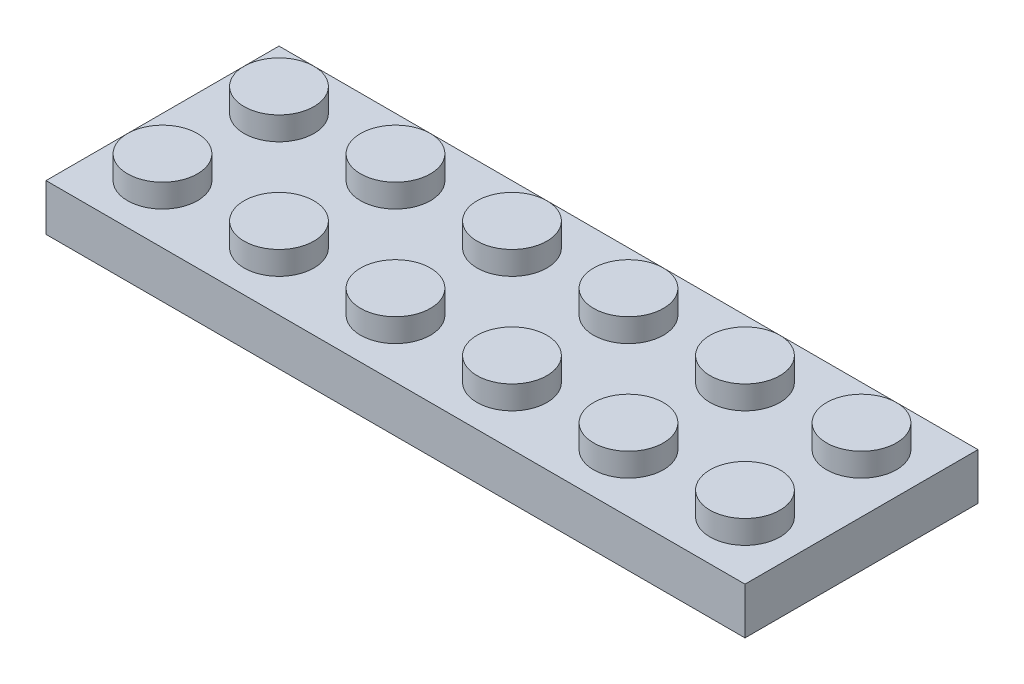
ISO-10303-21;
HEADER;
FILE_DESCRIPTION(('STEP AP214'),'2;1');
FILE_NAME('part.step','',(''),(''),'','','');
FILE_SCHEMA(('AUTOMOTIVE_DESIGN { 1 0 10303 214 1 1 1 1 }'));
ENDSEC;
DATA;
#1=APPLICATION_CONTEXT('core data for automotive mechanical design processes');
#2=APPLICATION_PROTOCOL_DEFINITION('international standard','automotive_design',2000,#1);
#3=PRODUCT_CONTEXT('',#1,'mechanical');
#4=PRODUCT('Part','Part','',(#3));
#5=PRODUCT_RELATED_PRODUCT_CATEGORY('part','',(#4));
#6=PRODUCT_DEFINITION_FORMATION('','',#4);
#7=PRODUCT_DEFINITION_CONTEXT('part definition',#1,'design');
#8=PRODUCT_DEFINITION('design','',#6,#7);
#9=PRODUCT_DEFINITION_SHAPE('','',#8);
#10=(LENGTH_UNIT() NAMED_UNIT(*) SI_UNIT(.MILLI.,.METRE.));
#11=(NAMED_UNIT(*) PLANE_ANGLE_UNIT() SI_UNIT($,.RADIAN.));
#12=(NAMED_UNIT(*) SI_UNIT($,.STERADIAN.) SOLID_ANGLE_UNIT());
#13=UNCERTAINTY_MEASURE_WITH_UNIT(LENGTH_MEASURE(1.E-05),#10,'distance_accuracy_value','');
#14=(GEOMETRIC_REPRESENTATION_CONTEXT(3) GLOBAL_UNCERTAINTY_ASSIGNED_CONTEXT((#13)) GLOBAL_UNIT_ASSIGNED_CONTEXT((#10,
#11,#12)) REPRESENTATION_CONTEXT('',''));
#15=CARTESIAN_POINT('',(0.,0.,0.));
#16=DIRECTION('',(0.,0.,1.));
#17=DIRECTION('',(1.,0.,0.));
#18=AXIS2_PLACEMENT_3D('',#15,#16,#17);
#19=CARTESIAN_POINT('',(-2.5,2.,-2.5));
#20=DIRECTION('',(0.,-1.,0.));
#21=DIRECTION('',(0.,0.,-1.));
#22=AXIS2_PLACEMENT_3D('',#19,#20,#21);
#23=CYLINDRICAL_SURFACE('',#22,1.5);
#24=CARTESIAN_POINT('',(-2.5,1.,-2.5));
#25=DIRECTION('',(0.,1.,0.));
#26=DIRECTION('',(0.,0.,1.));
#27=AXIS2_PLACEMENT_3D('',#24,#25,#26);
#28=CIRCLE('',#27,1.5);
#29=CARTESIAN_POINT('',(-2.5,1.,-1.));
#30=VERTEX_POINT('',#29);
#31=EDGE_CURVE('E185',#30,#30,#28,.T.);
#32=ORIENTED_EDGE('',*,*,#31,.T.);
#33=EDGE_LOOP('',(#32));
#34=FACE_BOUND('',#33,.T.);
#35=CARTESIAN_POINT('',(-2.5,2.,-2.5));
#36=DIRECTION('',(0.,1.,0.));
#37=DIRECTION('',(0.,0.,1.));
#38=AXIS2_PLACEMENT_3D('',#35,#36,#37);
#39=CIRCLE('',#38,1.5);
#40=CARTESIAN_POINT('',(-2.5,2.,-1.));
#41=VERTEX_POINT('',#40);
#42=EDGE_CURVE('E315',#41,#41,#39,.T.);
#43=ORIENTED_EDGE('',*,*,#42,.F.);
#44=EDGE_LOOP('',(#43));
#45=FACE_BOUND('',#44,.T.);
#46=ADVANCED_FACE('F110',(#34,#45),#23,.T.);
#47=CARTESIAN_POINT('',(0.,2.,0.));
#48=DIRECTION('',(0.,1.,0.));
#49=DIRECTION('',(0.,0.,1.));
#50=AXIS2_PLACEMENT_3D('',#47,#48,#49);
#51=PLANE('',#50);
#52=ORIENTED_EDGE('',*,*,#42,.T.);
#53=EDGE_LOOP('',(#52));
#54=FACE_BOUND('',#53,.T.);
#55=ADVANCED_FACE('F359',(#54),#51,.T.);
#56=CARTESIAN_POINT('',(-15.,1.,5.));
#57=DIRECTION('',(0.,0.,-1.));
#58=DIRECTION('',(-1.,0.,0.));
#59=AXIS2_PLACEMENT_3D('',#56,#57,#58);
#60=PLANE('',#59);
#61=DIRECTION('',(0.,-1.,0.));
#62=VECTOR('',#61,1.);
#63=CARTESIAN_POINT('',(-15.,1.,5.));
#64=LINE('',#63,#62);
#65=CARTESIAN_POINT('',(-15.,1.,5.));
#66=VERTEX_POINT('',#65);
#67=CARTESIAN_POINT('',(-15.,-1.,5.));
#68=VERTEX_POINT('',#67);
#69=EDGE_CURVE('E132',#66,#68,#64,.T.);
#70=ORIENTED_EDGE('',*,*,#69,.T.);
#71=DIRECTION('',(1.,0.,0.));
#72=VECTOR('',#71,1.);
#73=CARTESIAN_POINT('',(0.,-1.,5.));
#74=LINE('',#73,#72);
#75=CARTESIAN_POINT('',(15.,-1.,5.));
#76=VERTEX_POINT('',#75);
#77=EDGE_CURVE('E194',#68,#76,#74,.T.);
#78=ORIENTED_EDGE('',*,*,#77,.T.);
#79=DIRECTION('',(0.,-1.,0.));
#80=VECTOR('',#79,1.);
#81=CARTESIAN_POINT('',(15.,1.,5.));
#82=LINE('',#81,#80);
#83=CARTESIAN_POINT('',(15.,1.,5.));
#84=VERTEX_POINT('',#83);
#85=EDGE_CURVE('E176',#84,#76,#82,.T.);
#86=ORIENTED_EDGE('',*,*,#85,.F.);
#87=DIRECTION('',(1.,0.,0.));
#88=VECTOR('',#87,1.);
#89=CARTESIAN_POINT('',(-15.,1.,5.));
#90=LINE('',#89,#88);
#91=EDGE_CURVE('E303',#66,#84,#90,.T.);
#92=ORIENTED_EDGE('',*,*,#91,.F.);
#93=EDGE_LOOP('',(#70,#78,#86,#92));
#94=FACE_BOUND('',#93,.T.);
#95=ADVANCED_FACE('F198',(#94),#60,.F.);
#96=CARTESIAN_POINT('',(15.,1.,5.));
#97=DIRECTION('',(-1.,0.,0.));
#98=DIRECTION('',(0.,0.,1.));
#99=AXIS2_PLACEMENT_3D('',#96,#97,#98);
#100=PLANE('',#99);
#101=ORIENTED_EDGE('',*,*,#85,.T.);
#102=DIRECTION('',(0.,0.,-1.));
#103=VECTOR('',#102,1.);
#104=CARTESIAN_POINT('',(15.,-1.,0.));
#105=LINE('',#104,#103);
#106=CARTESIAN_POINT('',(15.,-1.,-5.));
#107=VERTEX_POINT('',#106);
#108=EDGE_CURVE('E180',#76,#107,#105,.T.);
#109=ORIENTED_EDGE('',*,*,#108,.T.);
#110=DIRECTION('',(0.,-1.,0.));
#111=VECTOR('',#110,1.);
#112=CARTESIAN_POINT('',(15.,1.,-5.));
#113=LINE('',#112,#111);
#114=CARTESIAN_POINT('',(15.,1.,-5.));
#115=VERTEX_POINT('',#114);
#116=EDGE_CURVE('E186',#115,#107,#113,.T.);
#117=ORIENTED_EDGE('',*,*,#116,.F.);
#118=DIRECTION('',(0.,0.,-1.));
#119=VECTOR('',#118,1.);
#120=CARTESIAN_POINT('',(15.,1.,5.));
#121=LINE('',#120,#119);
#122=EDGE_CURVE('E181',#84,#115,#121,.T.);
#123=ORIENTED_EDGE('',*,*,#122,.F.);
#124=EDGE_LOOP('',(#101,#109,#117,#123));
#125=FACE_BOUND('',#124,.T.);
#126=ADVANCED_FACE('F178',(#125),#100,.F.);
#127=CARTESIAN_POINT('',(-15.,1.,-5.));
#128=DIRECTION('',(0.,0.,-1.));
#129=DIRECTION('',(-1.,0.,0.));
#130=AXIS2_PLACEMENT_3D('',#127,#128,#129);
#131=PLANE('',#130);
#132=ORIENTED_EDGE('',*,*,#116,.T.);
#133=DIRECTION('',(1.,0.,0.));
#134=VECTOR('',#133,1.);
#135=CARTESIAN_POINT('',(0.,-1.,-5.));
#136=LINE('',#135,#134);
#137=CARTESIAN_POINT('',(-15.,-1.,-5.));
#138=VERTEX_POINT('',#137);
#139=EDGE_CURVE('E196',#138,#107,#136,.T.);
#140=ORIENTED_EDGE('',*,*,#139,.F.);
#141=DIRECTION('',(0.,-1.,0.));
#142=VECTOR('',#141,1.);
#143=CARTESIAN_POINT('',(-15.,1.,-5.));
#144=LINE('',#143,#142);
#145=CARTESIAN_POINT('',(-15.,1.,-5.));
#146=VERTEX_POINT('',#145);
#147=EDGE_CURVE('E312',#146,#138,#144,.T.);
#148=ORIENTED_EDGE('',*,*,#147,.F.);
#149=DIRECTION('',(1.,0.,0.));
#150=VECTOR('',#149,1.);
#151=CARTESIAN_POINT('',(-15.,1.,-5.));
#152=LINE('',#151,#150);
#153=EDGE_CURVE('E306',#146,#115,#152,.T.);
#154=ORIENTED_EDGE('',*,*,#153,.T.);
#155=EDGE_LOOP('',(#132,#140,#148,#154));
#156=FACE_BOUND('',#155,.T.);
#157=ADVANCED_FACE('F379',(#156),#131,.T.);
#158=CARTESIAN_POINT('',(-15.,1.,5.));
#159=DIRECTION('',(-1.,0.,0.));
#160=DIRECTION('',(0.,0.,1.));
#161=AXIS2_PLACEMENT_3D('',#158,#159,#160);
#162=PLANE('',#161);
#163=ORIENTED_EDGE('',*,*,#147,.T.);
#164=DIRECTION('',(0.,0.,-1.));
#165=VECTOR('',#164,1.);
#166=CARTESIAN_POINT('',(-15.,-1.,0.));
#167=LINE('',#166,#165);
#168=EDGE_CURVE('E208',#68,#138,#167,.T.);
#169=ORIENTED_EDGE('',*,*,#168,.F.);
#170=ORIENTED_EDGE('',*,*,#69,.F.);
#171=DIRECTION('',(0.,0.,-1.));
#172=VECTOR('',#171,1.);
#173=CARTESIAN_POINT('',(-15.,1.,5.));
#174=LINE('',#173,#172);
#175=EDGE_CURVE('E309',#66,#146,#174,.T.);
#176=ORIENTED_EDGE('',*,*,#175,.T.);
#177=EDGE_LOOP('',(#163,#169,#170,#176));
#178=FACE_BOUND('',#177,.T.);
#179=ADVANCED_FACE('F373',(#178),#162,.T.);
#180=CARTESIAN_POINT('',(0.,1.,0.));
#181=DIRECTION('',(0.,1.,0.));
#182=DIRECTION('',(0.,0.,1.));
#183=AXIS2_PLACEMENT_3D('',#180,#181,#182);
#184=PLANE('',#183);
#185=CARTESIAN_POINT('',(2.50000000000005,1.,2.5));
#186=DIRECTION('',(0.,1.,0.));
#187=DIRECTION('',(0.,0.,1.));
#188=AXIS2_PLACEMENT_3D('',#185,#186,#187);
#189=CIRCLE('',#188,1.5);
#190=CARTESIAN_POINT('',(2.50000000000005,1.,4.));
#191=VERTEX_POINT('',#190);
#192=EDGE_CURVE('E240',#191,#191,#189,.F.);
#193=ORIENTED_EDGE('',*,*,#192,.T.);
#194=EDGE_LOOP('',(#193));
#195=FACE_BOUND('',#194,.T.);
#196=CARTESIAN_POINT('',(7.50000000000005,1.,2.5));
#197=DIRECTION('',(0.,1.,0.));
#198=DIRECTION('',(0.,0.,1.));
#199=AXIS2_PLACEMENT_3D('',#196,#197,#198);
#200=CIRCLE('',#199,1.5);
#201=CARTESIAN_POINT('',(7.50000000000005,1.,4.));
#202=VERTEX_POINT('',#201);
#203=EDGE_CURVE('E246',#202,#202,#200,.F.);
#204=ORIENTED_EDGE('',*,*,#203,.T.);
#205=EDGE_LOOP('',(#204));
#206=FACE_BOUND('',#205,.T.);
#207=CARTESIAN_POINT('',(12.5000000000001,1.,2.5));
#208=DIRECTION('',(0.,1.,0.));
#209=DIRECTION('',(0.,0.,1.));
#210=AXIS2_PLACEMENT_3D('',#207,#208,#209);
#211=CIRCLE('',#210,1.5);
#212=CARTESIAN_POINT('',(12.5000000000001,1.,4.));
#213=VERTEX_POINT('',#212);
#214=EDGE_CURVE('E252',#213,#213,#211,.F.);
#215=ORIENTED_EDGE('',*,*,#214,.T.);
#216=EDGE_LOOP('',(#215));
#217=FACE_BOUND('',#216,.T.);
#218=CARTESIAN_POINT('',(12.5,1.,-2.5));
#219=DIRECTION('',(0.,1.,0.));
#220=DIRECTION('',(0.,0.,1.));
#221=AXIS2_PLACEMENT_3D('',#218,#219,#220);
#222=CIRCLE('',#221,1.5);
#223=CARTESIAN_POINT('',(12.5,1.,-1.));
#224=VERTEX_POINT('',#223);
#225=EDGE_CURVE('E258',#224,#224,#222,.F.);
#226=ORIENTED_EDGE('',*,*,#225,.T.);
#227=EDGE_LOOP('',(#226));
#228=FACE_BOUND('',#227,.T.);
#229=CARTESIAN_POINT('',(7.5,1.,-2.5));
#230=DIRECTION('',(0.,1.,0.));
#231=DIRECTION('',(0.,0.,1.));
#232=AXIS2_PLACEMENT_3D('',#229,#230,#231);
#233=CIRCLE('',#232,1.5);
#234=CARTESIAN_POINT('',(7.5,1.,-1.));
#235=VERTEX_POINT('',#234);
#236=EDGE_CURVE('E264',#235,#235,#233,.F.);
#237=ORIENTED_EDGE('',*,*,#236,.T.);
#238=EDGE_LOOP('',(#237));
#239=FACE_BOUND('',#238,.T.);
#240=CARTESIAN_POINT('',(2.5,1.,-2.5));
#241=DIRECTION('',(0.,1.,0.));
#242=DIRECTION('',(0.,0.,1.));
#243=AXIS2_PLACEMENT_3D('',#240,#241,#242);
#244=CIRCLE('',#243,1.5);
#245=CARTESIAN_POINT('',(2.5,1.,-1.));
#246=VERTEX_POINT('',#245);
#247=EDGE_CURVE('E270',#246,#246,#244,.F.);
#248=ORIENTED_EDGE('',*,*,#247,.T.);
#249=EDGE_LOOP('',(#248));
#250=FACE_BOUND('',#249,.T.);
#251=CARTESIAN_POINT('',(-2.49999999999995,1.,2.5));
#252=DIRECTION('',(0.,1.,0.));
#253=DIRECTION('',(0.,0.,1.));
#254=AXIS2_PLACEMENT_3D('',#251,#252,#253);
#255=CIRCLE('',#254,1.5);
#256=CARTESIAN_POINT('',(-2.49999999999995,1.,4.));
#257=VERTEX_POINT('',#256);
#258=EDGE_CURVE('E276',#257,#257,#255,.F.);
#259=ORIENTED_EDGE('',*,*,#258,.T.);
#260=EDGE_LOOP('',(#259));
#261=FACE_BOUND('',#260,.T.);
#262=CARTESIAN_POINT('',(-7.49999999999995,1.,2.5));
#263=DIRECTION('',(0.,1.,0.));
#264=DIRECTION('',(0.,0.,1.));
#265=AXIS2_PLACEMENT_3D('',#262,#263,#264);
#266=CIRCLE('',#265,1.5);
#267=CARTESIAN_POINT('',(-7.49999999999995,1.,4.));
#268=VERTEX_POINT('',#267);
#269=EDGE_CURVE('E282',#268,#268,#266,.F.);
#270=ORIENTED_EDGE('',*,*,#269,.T.);
#271=EDGE_LOOP('',(#270));
#272=FACE_BOUND('',#271,.T.);
#273=CARTESIAN_POINT('',(-12.4999999999999,1.,2.5));
#274=DIRECTION('',(0.,1.,0.));
#275=DIRECTION('',(0.,0.,1.));
#276=AXIS2_PLACEMENT_3D('',#273,#274,#275);
#277=CIRCLE('',#276,1.5);
#278=CARTESIAN_POINT('',(-12.4999999999999,1.,4.));
#279=VERTEX_POINT('',#278);
#280=EDGE_CURVE('E288',#279,#279,#277,.F.);
#281=ORIENTED_EDGE('',*,*,#280,.T.);
#282=EDGE_LOOP('',(#281));
#283=FACE_BOUND('',#282,.T.);
#284=CARTESIAN_POINT('',(-12.5,1.,-2.5));
#285=DIRECTION('',(0.,1.,0.));
#286=DIRECTION('',(0.,0.,1.));
#287=AXIS2_PLACEMENT_3D('',#284,#285,#286);
#288=CIRCLE('',#287,1.5);
#289=CARTESIAN_POINT('',(-12.5,1.,-1.));
#290=VERTEX_POINT('',#289);
#291=EDGE_CURVE('E294',#290,#290,#288,.F.);
#292=ORIENTED_EDGE('',*,*,#291,.T.);
#293=EDGE_LOOP('',(#292));
#294=FACE_BOUND('',#293,.T.);
#295=CARTESIAN_POINT('',(-7.5,1.,-2.5));
#296=DIRECTION('',(0.,1.,0.));
#297=DIRECTION('',(0.,0.,1.));
#298=AXIS2_PLACEMENT_3D('',#295,#296,#297);
#299=CIRCLE('',#298,1.5);
#300=CARTESIAN_POINT('',(-7.5,1.,-1.));
#301=VERTEX_POINT('',#300);
#302=EDGE_CURVE('E300',#301,#301,#299,.F.);
#303=ORIENTED_EDGE('',*,*,#302,.T.);
#304=EDGE_LOOP('',(#303));
#305=FACE_BOUND('',#304,.T.);
#306=ORIENTED_EDGE('',*,*,#31,.F.);
#307=EDGE_LOOP('',(#306));
#308=FACE_BOUND('',#307,.T.);
#309=ORIENTED_EDGE('',*,*,#91,.T.);
#310=ORIENTED_EDGE('',*,*,#122,.T.);
#311=ORIENTED_EDGE('',*,*,#153,.F.);
#312=ORIENTED_EDGE('',*,*,#175,.F.);
#313=EDGE_LOOP('',(#309,#310,#311,#312));
#314=FACE_BOUND('',#313,.T.);
#315=ADVANCED_FACE('F369',(#195,#206,#217,#228,#239,#250,#261,#272,#283,#294,#305,#308,#314),
#184,.T.);
#316=CARTESIAN_POINT('',(-7.5,2.,-2.5));
#317=DIRECTION('',(0.,-1.,0.));
#318=DIRECTION('',(0.,0.,-1.));
#319=AXIS2_PLACEMENT_3D('',#316,#317,#318);
#320=CYLINDRICAL_SURFACE('',#319,1.5);
#321=ORIENTED_EDGE('',*,*,#302,.F.);
#322=EDGE_LOOP('',(#321));
#323=FACE_BOUND('',#322,.T.);
#324=CARTESIAN_POINT('',(-7.5,2.,-2.5));
#325=DIRECTION('',(0.,1.,0.));
#326=DIRECTION('',(0.,0.,1.));
#327=AXIS2_PLACEMENT_3D('',#324,#325,#326);
#328=CIRCLE('',#327,1.5);
#329=CARTESIAN_POINT('',(-7.5,2.,-1.));
#330=VERTEX_POINT('',#329);
#331=EDGE_CURVE('E297',#330,#330,#328,.T.);
#332=ORIENTED_EDGE('',*,*,#331,.F.);
#333=EDGE_LOOP('',(#332));
#334=FACE_BOUND('',#333,.T.);
#335=ADVANCED_FACE('F372',(#323,#334),#320,.T.);
#336=CARTESIAN_POINT('',(0.,2.,0.));
#337=DIRECTION('',(0.,1.,0.));
#338=DIRECTION('',(0.,0.,1.));
#339=AXIS2_PLACEMENT_3D('',#336,#337,#338);
#340=PLANE('',#339);
#341=ORIENTED_EDGE('',*,*,#331,.T.);
#342=EDGE_LOOP('',(#341));
#343=FACE_BOUND('',#342,.T.);
#344=ADVANCED_FACE('F679',(#343),#340,.T.);
#345=CARTESIAN_POINT('',(-12.5,2.,-2.5));
#346=DIRECTION('',(0.,-1.,0.));
#347=DIRECTION('',(0.,0.,-1.));
#348=AXIS2_PLACEMENT_3D('',#345,#346,#347);
#349=CYLINDRICAL_SURFACE('',#348,1.5);
#350=ORIENTED_EDGE('',*,*,#291,.F.);
#351=EDGE_LOOP('',(#350));
#352=FACE_BOUND('',#351,.T.);
#353=CARTESIAN_POINT('',(-12.5,2.,-2.5));
#354=DIRECTION('',(0.,1.,0.));
#355=DIRECTION('',(0.,0.,1.));
#356=AXIS2_PLACEMENT_3D('',#353,#354,#355);
#357=CIRCLE('',#356,1.5);
#358=CARTESIAN_POINT('',(-12.5,2.,-1.));
#359=VERTEX_POINT('',#358);
#360=EDGE_CURVE('E291',#359,#359,#357,.T.);
#361=ORIENTED_EDGE('',*,*,#360,.F.);
#362=EDGE_LOOP('',(#361));
#363=FACE_BOUND('',#362,.T.);
#364=ADVANCED_FACE('F689',(#352,#363),#349,.T.);
#365=CARTESIAN_POINT('',(0.,2.,0.));
#366=DIRECTION('',(0.,1.,0.));
#367=DIRECTION('',(0.,0.,1.));
#368=AXIS2_PLACEMENT_3D('',#365,#366,#367);
#369=PLANE('',#368);
#370=ORIENTED_EDGE('',*,*,#360,.T.);
#371=EDGE_LOOP('',(#370));
#372=FACE_BOUND('',#371,.T.);
#373=ADVANCED_FACE('F699',(#372),#369,.T.);
#374=CARTESIAN_POINT('',(-12.4999999999999,2.,2.5));
#375=DIRECTION('',(0.,-1.,0.));
#376=DIRECTION('',(0.,0.,-1.));
#377=AXIS2_PLACEMENT_3D('',#374,#375,#376);
#378=CYLINDRICAL_SURFACE('',#377,1.5);
#379=ORIENTED_EDGE('',*,*,#280,.F.);
#380=EDGE_LOOP('',(#379));
#381=FACE_BOUND('',#380,.T.);
#382=CARTESIAN_POINT('',(-12.4999999999999,2.,2.5));
#383=DIRECTION('',(0.,1.,0.));
#384=DIRECTION('',(0.,0.,1.));
#385=AXIS2_PLACEMENT_3D('',#382,#383,#384);
#386=CIRCLE('',#385,1.5);
#387=CARTESIAN_POINT('',(-12.4999999999999,2.,4.));
#388=VERTEX_POINT('',#387);
#389=EDGE_CURVE('E285',#388,#388,#386,.T.);
#390=ORIENTED_EDGE('',*,*,#389,.F.);
#391=EDGE_LOOP('',(#390));
#392=FACE_BOUND('',#391,.T.);
#393=ADVANCED_FACE('F709',(#381,#392),#378,.T.);
#394=CARTESIAN_POINT('',(0.,2.,0.));
#395=DIRECTION('',(0.,1.,0.));
#396=DIRECTION('',(0.,0.,1.));
#397=AXIS2_PLACEMENT_3D('',#394,#395,#396);
#398=PLANE('',#397);
#399=ORIENTED_EDGE('',*,*,#389,.T.);
#400=EDGE_LOOP('',(#399));
#401=FACE_BOUND('',#400,.T.);
#402=ADVANCED_FACE('F719',(#401),#398,.T.);
#403=CARTESIAN_POINT('',(-7.49999999999995,2.,2.5));
#404=DIRECTION('',(0.,-1.,0.));
#405=DIRECTION('',(0.,0.,-1.));
#406=AXIS2_PLACEMENT_3D('',#403,#404,#405);
#407=CYLINDRICAL_SURFACE('',#406,1.5);
#408=ORIENTED_EDGE('',*,*,#269,.F.);
#409=EDGE_LOOP('',(#408));
#410=FACE_BOUND('',#409,.T.);
#411=CARTESIAN_POINT('',(-7.49999999999995,2.,2.5));
#412=DIRECTION('',(0.,1.,0.));
#413=DIRECTION('',(0.,0.,1.));
#414=AXIS2_PLACEMENT_3D('',#411,#412,#413);
#415=CIRCLE('',#414,1.5);
#416=CARTESIAN_POINT('',(-7.49999999999995,2.,4.));
#417=VERTEX_POINT('',#416);
#418=EDGE_CURVE('E279',#417,#417,#415,.T.);
#419=ORIENTED_EDGE('',*,*,#418,.F.);
#420=EDGE_LOOP('',(#419));
#421=FACE_BOUND('',#420,.T.);
#422=ADVANCED_FACE('F729',(#410,#421),#407,.T.);
#423=CARTESIAN_POINT('',(0.,2.,0.));
#424=DIRECTION('',(0.,1.,0.));
#425=DIRECTION('',(0.,0.,1.));
#426=AXIS2_PLACEMENT_3D('',#423,#424,#425);
#427=PLANE('',#426);
#428=ORIENTED_EDGE('',*,*,#418,.T.);
#429=EDGE_LOOP('',(#428));
#430=FACE_BOUND('',#429,.T.);
#431=ADVANCED_FACE('F739',(#430),#427,.T.);
#432=CARTESIAN_POINT('',(-2.49999999999995,2.,2.5));
#433=DIRECTION('',(0.,-1.,0.));
#434=DIRECTION('',(0.,0.,-1.));
#435=AXIS2_PLACEMENT_3D('',#432,#433,#434);
#436=CYLINDRICAL_SURFACE('',#435,1.5);
#437=ORIENTED_EDGE('',*,*,#258,.F.);
#438=EDGE_LOOP('',(#437));
#439=FACE_BOUND('',#438,.T.);
#440=CARTESIAN_POINT('',(-2.49999999999995,2.,2.5));
#441=DIRECTION('',(0.,1.,0.));
#442=DIRECTION('',(0.,0.,1.));
#443=AXIS2_PLACEMENT_3D('',#440,#441,#442);
#444=CIRCLE('',#443,1.5);
#445=CARTESIAN_POINT('',(-2.49999999999995,2.,4.));
#446=VERTEX_POINT('',#445);
#447=EDGE_CURVE('E273',#446,#446,#444,.T.);
#448=ORIENTED_EDGE('',*,*,#447,.F.);
#449=EDGE_LOOP('',(#448));
#450=FACE_BOUND('',#449,.T.);
#451=ADVANCED_FACE('F749',(#439,#450),#436,.T.);
#452=CARTESIAN_POINT('',(0.,2.,0.));
#453=DIRECTION('',(0.,1.,0.));
#454=DIRECTION('',(0.,0.,1.));
#455=AXIS2_PLACEMENT_3D('',#452,#453,#454);
#456=PLANE('',#455);
#457=ORIENTED_EDGE('',*,*,#447,.T.);
#458=EDGE_LOOP('',(#457));
#459=FACE_BOUND('',#458,.T.);
#460=ADVANCED_FACE('F759',(#459),#456,.T.);
#461=CARTESIAN_POINT('',(2.5,2.,-2.5));
#462=DIRECTION('',(0.,-1.,0.));
#463=DIRECTION('',(0.,0.,-1.));
#464=AXIS2_PLACEMENT_3D('',#461,#462,#463);
#465=CYLINDRICAL_SURFACE('',#464,1.5);
#466=ORIENTED_EDGE('',*,*,#247,.F.);
#467=EDGE_LOOP('',(#466));
#468=FACE_BOUND('',#467,.T.);
#469=CARTESIAN_POINT('',(2.5,2.,-2.5));
#470=DIRECTION('',(0.,1.,0.));
#471=DIRECTION('',(0.,0.,1.));
#472=AXIS2_PLACEMENT_3D('',#469,#470,#471);
#473=CIRCLE('',#472,1.5);
#474=CARTESIAN_POINT('',(2.5,2.,-1.));
#475=VERTEX_POINT('',#474);
#476=EDGE_CURVE('E267',#475,#475,#473,.T.);
#477=ORIENTED_EDGE('',*,*,#476,.F.);
#478=EDGE_LOOP('',(#477));
#479=FACE_BOUND('',#478,.T.);
#480=ADVANCED_FACE('F769',(#468,#479),#465,.T.);
#481=CARTESIAN_POINT('',(0.,2.,0.));
#482=DIRECTION('',(0.,1.,0.));
#483=DIRECTION('',(0.,0.,1.));
#484=AXIS2_PLACEMENT_3D('',#481,#482,#483);
#485=PLANE('',#484);
#486=ORIENTED_EDGE('',*,*,#476,.T.);
#487=EDGE_LOOP('',(#486));
#488=FACE_BOUND('',#487,.T.);
#489=ADVANCED_FACE('F779',(#488),#485,.T.);
#490=CARTESIAN_POINT('',(7.5,2.,-2.5));
#491=DIRECTION('',(0.,-1.,0.));
#492=DIRECTION('',(0.,0.,-1.));
#493=AXIS2_PLACEMENT_3D('',#490,#491,#492);
#494=CYLINDRICAL_SURFACE('',#493,1.5);
#495=ORIENTED_EDGE('',*,*,#236,.F.);
#496=EDGE_LOOP('',(#495));
#497=FACE_BOUND('',#496,.T.);
#498=CARTESIAN_POINT('',(7.5,2.,-2.5));
#499=DIRECTION('',(0.,1.,0.));
#500=DIRECTION('',(0.,0.,1.));
#501=AXIS2_PLACEMENT_3D('',#498,#499,#500);
#502=CIRCLE('',#501,1.5);
#503=CARTESIAN_POINT('',(7.5,2.,-1.));
#504=VERTEX_POINT('',#503);
#505=EDGE_CURVE('E261',#504,#504,#502,.T.);
#506=ORIENTED_EDGE('',*,*,#505,.F.);
#507=EDGE_LOOP('',(#506));
#508=FACE_BOUND('',#507,.T.);
#509=ADVANCED_FACE('F789',(#497,#508),#494,.T.);
#510=CARTESIAN_POINT('',(0.,2.,0.));
#511=DIRECTION('',(0.,1.,0.));
#512=DIRECTION('',(0.,0.,1.));
#513=AXIS2_PLACEMENT_3D('',#510,#511,#512);
#514=PLANE('',#513);
#515=ORIENTED_EDGE('',*,*,#505,.T.);
#516=EDGE_LOOP('',(#515));
#517=FACE_BOUND('',#516,.T.);
#518=ADVANCED_FACE('F799',(#517),#514,.T.);
#519=CARTESIAN_POINT('',(12.5,2.,-2.5));
#520=DIRECTION('',(0.,-1.,0.));
#521=DIRECTION('',(0.,0.,-1.));
#522=AXIS2_PLACEMENT_3D('',#519,#520,#521);
#523=CYLINDRICAL_SURFACE('',#522,1.5);
#524=ORIENTED_EDGE('',*,*,#225,.F.);
#525=EDGE_LOOP('',(#524));
#526=FACE_BOUND('',#525,.T.);
#527=CARTESIAN_POINT('',(12.5,2.,-2.5));
#528=DIRECTION('',(0.,1.,0.));
#529=DIRECTION('',(0.,0.,1.));
#530=AXIS2_PLACEMENT_3D('',#527,#528,#529);
#531=CIRCLE('',#530,1.5);
#532=CARTESIAN_POINT('',(12.5,2.,-1.));
#533=VERTEX_POINT('',#532);
#534=EDGE_CURVE('E255',#533,#533,#531,.T.);
#535=ORIENTED_EDGE('',*,*,#534,.F.);
#536=EDGE_LOOP('',(#535));
#537=FACE_BOUND('',#536,.T.);
#538=ADVANCED_FACE('F809',(#526,#537),#523,.T.);
#539=CARTESIAN_POINT('',(0.,2.,0.));
#540=DIRECTION('',(0.,1.,0.));
#541=DIRECTION('',(0.,0.,1.));
#542=AXIS2_PLACEMENT_3D('',#539,#540,#541);
#543=PLANE('',#542);
#544=ORIENTED_EDGE('',*,*,#534,.T.);
#545=EDGE_LOOP('',(#544));
#546=FACE_BOUND('',#545,.T.);
#547=ADVANCED_FACE('F819',(#546),#543,.T.);
#548=CARTESIAN_POINT('',(12.5000000000001,2.,2.5));
#549=DIRECTION('',(0.,-1.,0.));
#550=DIRECTION('',(0.,0.,-1.));
#551=AXIS2_PLACEMENT_3D('',#548,#549,#550);
#552=CYLINDRICAL_SURFACE('',#551,1.5);
#553=ORIENTED_EDGE('',*,*,#214,.F.);
#554=EDGE_LOOP('',(#553));
#555=FACE_BOUND('',#554,.T.);
#556=CARTESIAN_POINT('',(12.5000000000001,2.,2.5));
#557=DIRECTION('',(0.,1.,0.));
#558=DIRECTION('',(0.,0.,1.));
#559=AXIS2_PLACEMENT_3D('',#556,#557,#558);
#560=CIRCLE('',#559,1.5);
#561=CARTESIAN_POINT('',(12.5000000000001,2.,4.));
#562=VERTEX_POINT('',#561);
#563=EDGE_CURVE('E249',#562,#562,#560,.T.);
#564=ORIENTED_EDGE('',*,*,#563,.F.);
#565=EDGE_LOOP('',(#564));
#566=FACE_BOUND('',#565,.T.);
#567=ADVANCED_FACE('F829',(#555,#566),#552,.T.);
#568=CARTESIAN_POINT('',(0.,2.,0.));
#569=DIRECTION('',(0.,1.,0.));
#570=DIRECTION('',(0.,0.,1.));
#571=AXIS2_PLACEMENT_3D('',#568,#569,#570);
#572=PLANE('',#571);
#573=ORIENTED_EDGE('',*,*,#563,.T.);
#574=EDGE_LOOP('',(#573));
#575=FACE_BOUND('',#574,.T.);
#576=ADVANCED_FACE('F839',(#575),#572,.T.);
#577=CARTESIAN_POINT('',(7.50000000000005,2.,2.5));
#578=DIRECTION('',(0.,-1.,0.));
#579=DIRECTION('',(0.,0.,-1.));
#580=AXIS2_PLACEMENT_3D('',#577,#578,#579);
#581=CYLINDRICAL_SURFACE('',#580,1.5);
#582=ORIENTED_EDGE('',*,*,#203,.F.);
#583=EDGE_LOOP('',(#582));
#584=FACE_BOUND('',#583,.T.);
#585=CARTESIAN_POINT('',(7.50000000000005,2.,2.5));
#586=DIRECTION('',(0.,1.,0.));
#587=DIRECTION('',(0.,0.,1.));
#588=AXIS2_PLACEMENT_3D('',#585,#586,#587);
#589=CIRCLE('',#588,1.5);
#590=CARTESIAN_POINT('',(7.50000000000005,2.,4.));
#591=VERTEX_POINT('',#590);
#592=EDGE_CURVE('E243',#591,#591,#589,.T.);
#593=ORIENTED_EDGE('',*,*,#592,.F.);
#594=EDGE_LOOP('',(#593));
#595=FACE_BOUND('',#594,.T.);
#596=ADVANCED_FACE('F849',(#584,#595),#581,.T.);
#597=CARTESIAN_POINT('',(0.,2.,0.));
#598=DIRECTION('',(0.,1.,0.));
#599=DIRECTION('',(0.,0.,1.));
#600=AXIS2_PLACEMENT_3D('',#597,#598,#599);
#601=PLANE('',#600);
#602=ORIENTED_EDGE('',*,*,#592,.T.);
#603=EDGE_LOOP('',(#602));
#604=FACE_BOUND('',#603,.T.);
#605=ADVANCED_FACE('F859',(#604),#601,.T.);
#606=CARTESIAN_POINT('',(2.50000000000005,2.,2.5));
#607=DIRECTION('',(0.,-1.,0.));
#608=DIRECTION('',(0.,0.,-1.));
#609=AXIS2_PLACEMENT_3D('',#606,#607,#608);
#610=CYLINDRICAL_SURFACE('',#609,1.5);
#611=ORIENTED_EDGE('',*,*,#192,.F.);
#612=EDGE_LOOP('',(#611));
#613=FACE_BOUND('',#612,.T.);
#614=CARTESIAN_POINT('',(2.50000000000005,2.,2.5));
#615=DIRECTION('',(0.,1.,0.));
#616=DIRECTION('',(0.,0.,1.));
#617=AXIS2_PLACEMENT_3D('',#614,#615,#616);
#618=CIRCLE('',#617,1.5);
#619=CARTESIAN_POINT('',(2.50000000000005,2.,4.));
#620=VERTEX_POINT('',#619);
#621=EDGE_CURVE('E232',#620,#620,#618,.T.);
#622=ORIENTED_EDGE('',*,*,#621,.F.);
#623=EDGE_LOOP('',(#622));
#624=FACE_BOUND('',#623,.T.);
#625=ADVANCED_FACE('F869',(#613,#624),#610,.T.);
#626=CARTESIAN_POINT('',(0.,2.,0.));
#627=DIRECTION('',(0.,1.,0.));
#628=DIRECTION('',(0.,0.,1.));
#629=AXIS2_PLACEMENT_3D('',#626,#627,#628);
#630=PLANE('',#629);
#631=ORIENTED_EDGE('',*,*,#621,.T.);
#632=EDGE_LOOP('',(#631));
#633=FACE_BOUND('',#632,.T.);
#634=ADVANCED_FACE('F423',(#633),#630,.T.);
#635=CARTESIAN_POINT('',(0.,-1.,-4.));
#636=DIRECTION('',(0.,0.,1.));
#637=DIRECTION('',(1.,0.,0.));
#638=AXIS2_PLACEMENT_3D('',#635,#636,#637);
#639=PLANE('',#638);
#640=DIRECTION('',(1.,0.,0.));
#641=VECTOR('',#640,1.);
#642=CARTESIAN_POINT('',(0.,0.,-4.));
#643=LINE('',#642,#641);
#644=CARTESIAN_POINT('',(-14.,0.,-4.));
#645=VERTEX_POINT('',#644);
#646=CARTESIAN_POINT('',(14.,0.,-4.));
#647=VERTEX_POINT('',#646);
#648=EDGE_CURVE('E222',#645,#647,#643,.T.);
#649=ORIENTED_EDGE('',*,*,#648,.F.);
#650=DIRECTION('',(0.,1.,0.));
#651=VECTOR('',#650,1.);
#652=CARTESIAN_POINT('',(-14.,-1.,-4.));
#653=LINE('',#652,#651);
#654=CARTESIAN_POINT('',(-14.,-1.,-4.));
#655=VERTEX_POINT('',#654);
#656=EDGE_CURVE('E230',#655,#645,#653,.T.);
#657=ORIENTED_EDGE('',*,*,#656,.F.);
#658=DIRECTION('',(1.,0.,0.));
#659=VECTOR('',#658,1.);
#660=CARTESIAN_POINT('',(0.,-1.,-4.));
#661=LINE('',#660,#659);
#662=CARTESIAN_POINT('',(14.,-1.,-4.));
#663=VERTEX_POINT('',#662);
#664=EDGE_CURVE('E210',#655,#663,#661,.T.);
#665=ORIENTED_EDGE('',*,*,#664,.T.);
#666=DIRECTION('',(0.,1.,0.));
#667=VECTOR('',#666,1.);
#668=CARTESIAN_POINT('',(14.,-1.,-4.));
#669=LINE('',#668,#667);
#670=EDGE_CURVE('E221',#663,#647,#669,.T.);
#671=ORIENTED_EDGE('',*,*,#670,.T.);
#672=EDGE_LOOP('',(#649,#657,#665,#671));
#673=FACE_BOUND('',#672,.T.);
#674=ADVANCED_FACE('F418',(#673),#639,.T.);
#675=CARTESIAN_POINT('',(-14.,-1.,0.));
#676=DIRECTION('',(-1.,0.,0.));
#677=DIRECTION('',(0.,0.,1.));
#678=AXIS2_PLACEMENT_3D('',#675,#676,#677);
#679=PLANE('',#678);
#680=DIRECTION('',(0.,0.,1.));
#681=VECTOR('',#680,1.);
#682=CARTESIAN_POINT('',(-14.,0.,0.));
#683=LINE('',#682,#681);
#684=CARTESIAN_POINT('',(-14.,0.,4.00000000000005));
#685=VERTEX_POINT('',#684);
#686=EDGE_CURVE('E199',#645,#685,#683,.T.);
#687=ORIENTED_EDGE('',*,*,#686,.T.);
#688=DIRECTION('',(0.,1.,0.));
#689=VECTOR('',#688,1.);
#690=CARTESIAN_POINT('',(-14.,-1.,4.00000000000005));
#691=LINE('',#690,#689);
#692=CARTESIAN_POINT('',(-14.,-1.,4.00000000000005));
#693=VERTEX_POINT('',#692);
#694=EDGE_CURVE('E233',#693,#685,#691,.T.);
#695=ORIENTED_EDGE('',*,*,#694,.F.);
#696=DIRECTION('',(0.,0.,1.));
#697=VECTOR('',#696,1.);
#698=CARTESIAN_POINT('',(-14.,-1.,0.));
#699=LINE('',#698,#697);
#700=EDGE_CURVE('E218',#655,#693,#699,.T.);
#701=ORIENTED_EDGE('',*,*,#700,.F.);
#702=ORIENTED_EDGE('',*,*,#656,.T.);
#703=EDGE_LOOP('',(#687,#695,#701,#702));
#704=FACE_BOUND('',#703,.T.);
#705=ADVANCED_FACE('F422',(#704),#679,.F.);
#706=CARTESIAN_POINT('',(0.,-1.,4.00000000000005));
#707=DIRECTION('',(0.,0.,1.));
#708=DIRECTION('',(1.,0.,0.));
#709=AXIS2_PLACEMENT_3D('',#706,#707,#708);
#710=PLANE('',#709);
#711=DIRECTION('',(1.,0.,0.));
#712=VECTOR('',#711,1.);
#713=CARTESIAN_POINT('',(0.,0.,4.00000000000005));
#714=LINE('',#713,#712);
#715=CARTESIAN_POINT('',(14.,0.,4.00000000000005));
#716=VERTEX_POINT('',#715);
#717=EDGE_CURVE('E124',#685,#716,#714,.T.);
#718=ORIENTED_EDGE('',*,*,#717,.T.);
#719=DIRECTION('',(0.,1.,0.));
#720=VECTOR('',#719,1.);
#721=CARTESIAN_POINT('',(14.,-1.,4.00000000000005));
#722=LINE('',#721,#720);
#723=CARTESIAN_POINT('',(14.,-1.,4.00000000000005));
#724=VERTEX_POINT('',#723);
#725=EDGE_CURVE('E235',#724,#716,#722,.T.);
#726=ORIENTED_EDGE('',*,*,#725,.F.);
#727=DIRECTION('',(1.,0.,0.));
#728=VECTOR('',#727,1.);
#729=CARTESIAN_POINT('',(0.,-1.,4.00000000000005));
#730=LINE('',#729,#728);
#731=EDGE_CURVE('E216',#693,#724,#730,.T.);
#732=ORIENTED_EDGE('',*,*,#731,.F.);
#733=ORIENTED_EDGE('',*,*,#694,.T.);
#734=EDGE_LOOP('',(#718,#726,#732,#733));
#735=FACE_BOUND('',#734,.T.);
#736=ADVANCED_FACE('F434',(#735),#710,.F.);
#737=CARTESIAN_POINT('',(14.,-1.,0.));
#738=DIRECTION('',(-1.,0.,0.));
#739=DIRECTION('',(0.,0.,1.));
#740=AXIS2_PLACEMENT_3D('',#737,#738,#739);
#741=PLANE('',#740);
#742=DIRECTION('',(0.,0.,1.));
#743=VECTOR('',#742,1.);
#744=CARTESIAN_POINT('',(14.,0.,0.));
#745=LINE('',#744,#743);
#746=EDGE_CURVE('E225',#647,#716,#745,.T.);
#747=ORIENTED_EDGE('',*,*,#746,.F.);
#748=ORIENTED_EDGE('',*,*,#670,.F.);
#749=DIRECTION('',(0.,0.,1.));
#750=VECTOR('',#749,1.);
#751=CARTESIAN_POINT('',(14.,-1.,0.));
#752=LINE('',#751,#750);
#753=EDGE_CURVE('E213',#663,#724,#752,.T.);
#754=ORIENTED_EDGE('',*,*,#753,.T.);
#755=ORIENTED_EDGE('',*,*,#725,.T.);
#756=EDGE_LOOP('',(#747,#748,#754,#755));
#757=FACE_BOUND('',#756,.T.);
#758=ADVANCED_FACE('F444',(#757),#741,.T.);
#759=CARTESIAN_POINT('',(0.,-1.,0.));
#760=DIRECTION('',(0.,1.,0.));
#761=DIRECTION('',(0.,0.,1.));
#762=AXIS2_PLACEMENT_3D('',#759,#760,#761);
#763=PLANE('',#762);
#764=ORIENTED_EDGE('',*,*,#77,.F.);
#765=ORIENTED_EDGE('',*,*,#168,.T.);
#766=ORIENTED_EDGE('',*,*,#139,.T.);
#767=ORIENTED_EDGE('',*,*,#108,.F.);
#768=EDGE_LOOP('',(#764,#765,#766,#767));
#769=FACE_BOUND('',#768,.T.);
#770=ORIENTED_EDGE('',*,*,#664,.F.);
#771=ORIENTED_EDGE('',*,*,#700,.T.);
#772=ORIENTED_EDGE('',*,*,#731,.T.);
#773=ORIENTED_EDGE('',*,*,#753,.F.);
#774=EDGE_LOOP('',(#770,#771,#772,#773));
#775=FACE_BOUND('',#774,.T.);
#776=ADVANCED_FACE('F191',(#769,#775),#763,.F.);
#777=CARTESIAN_POINT('',(0.,0.,0.));
#778=DIRECTION('',(0.,1.,0.));
#779=DIRECTION('',(0.,0.,1.));
#780=AXIS2_PLACEMENT_3D('',#777,#778,#779);
#781=PLANE('',#780);
#782=CARTESIAN_POINT('',(10.,0.,0.));
#783=DIRECTION('',(0.,1.,0.));
#784=DIRECTION('',(0.,0.,1.));
#785=AXIS2_PLACEMENT_3D('',#782,#783,#784);
#786=CIRCLE('',#785,2.03553390593276);
#787=CARTESIAN_POINT('',(10.,0.,2.03553390593278));
#788=VERTEX_POINT('',#787);
#789=EDGE_CURVE('E949',#788,#788,#786,.T.);
#790=ORIENTED_EDGE('',*,*,#789,.T.);
#791=EDGE_LOOP('',(#790));
#792=FACE_BOUND('',#791,.T.);
#793=CARTESIAN_POINT('',(5.,0.,0.));
#794=DIRECTION('',(0.,1.,0.));
#795=DIRECTION('',(0.,0.,1.));
#796=AXIS2_PLACEMENT_3D('',#793,#794,#795);
#797=CIRCLE('',#796,2.03553390593276);
#798=CARTESIAN_POINT('',(5.,0.,2.03553390593278));
#799=VERTEX_POINT('',#798);
#800=EDGE_CURVE('E944',#799,#799,#797,.T.);
#801=ORIENTED_EDGE('',*,*,#800,.T.);
#802=EDGE_LOOP('',(#801));
#803=FACE_BOUND('',#802,.T.);
#804=CARTESIAN_POINT('',(0.,0.,0.));
#805=DIRECTION('',(0.,1.,0.));
#806=DIRECTION('',(0.,0.,1.));
#807=AXIS2_PLACEMENT_3D('',#804,#805,#806);
#808=CIRCLE('',#807,2.03553390593276);
#809=CARTESIAN_POINT('',(0.,0.,2.03553390593278));
#810=VERTEX_POINT('',#809);
#811=EDGE_CURVE('E958',#810,#810,#808,.T.);
#812=ORIENTED_EDGE('',*,*,#811,.T.);
#813=EDGE_LOOP('',(#812));
#814=FACE_BOUND('',#813,.T.);
#815=CARTESIAN_POINT('',(-5.,0.,0.));
#816=DIRECTION('',(0.,1.,0.));
#817=DIRECTION('',(0.,0.,1.));
#818=AXIS2_PLACEMENT_3D('',#815,#816,#817);
#819=CIRCLE('',#818,2.03553390593276);
#820=CARTESIAN_POINT('',(-5.,0.,2.03553390593278));
#821=VERTEX_POINT('',#820);
#822=EDGE_CURVE('E966',#821,#821,#819,.T.);
#823=ORIENTED_EDGE('',*,*,#822,.T.);
#824=EDGE_LOOP('',(#823));
#825=FACE_BOUND('',#824,.T.);
#826=CARTESIAN_POINT('',(-10.,0.,0.));
#827=DIRECTION('',(0.,1.,0.));
#828=DIRECTION('',(0.,0.,1.));
#829=AXIS2_PLACEMENT_3D('',#826,#827,#828);
#830=CIRCLE('',#829,2.03553390593276);
#831=CARTESIAN_POINT('',(-10.,0.,2.03553390593278));
#832=VERTEX_POINT('',#831);
#833=EDGE_CURVE('E204',#832,#832,#830,.T.);
#834=ORIENTED_EDGE('',*,*,#833,.T.);
#835=EDGE_LOOP('',(#834));
#836=FACE_BOUND('',#835,.T.);
#837=ORIENTED_EDGE('',*,*,#686,.F.);
#838=ORIENTED_EDGE('',*,*,#648,.T.);
#839=ORIENTED_EDGE('',*,*,#746,.T.);
#840=ORIENTED_EDGE('',*,*,#717,.F.);
#841=EDGE_LOOP('',(#837,#838,#839,#840));
#842=FACE_BOUND('',#841,.T.);
#843=ADVANCED_FACE('F349',(#792,#803,#814,#825,#836,#842),#781,.F.);
#844=CARTESIAN_POINT('',(-10.,-1.,0.));
#845=DIRECTION('',(0.,1.,0.));
#846=DIRECTION('',(0.,0.,1.));
#847=AXIS2_PLACEMENT_3D('',#844,#845,#846);
#848=CYLINDRICAL_SURFACE('',#847,1.5);
#849=CARTESIAN_POINT('',(-10.,-1.,0.));
#850=DIRECTION('',(0.,1.,0.));
#851=DIRECTION('',(0.,0.,1.));
#852=AXIS2_PLACEMENT_3D('',#849,#850,#851);
#853=CIRCLE('',#852,1.5);
#854=CARTESIAN_POINT('',(-10.,-1.,1.50000000000003));
#855=VERTEX_POINT('',#854);
#856=EDGE_CURVE('E977',#855,#855,#853,.T.);
#857=ORIENTED_EDGE('',*,*,#856,.F.);
#858=EDGE_LOOP('',(#857));
#859=FACE_BOUND('',#858,.T.);
#860=CARTESIAN_POINT('',(-10.,0.,0.));
#861=DIRECTION('',(0.,1.,0.));
#862=DIRECTION('',(0.,0.,1.));
#863=AXIS2_PLACEMENT_3D('',#860,#861,#862);
#864=CIRCLE('',#863,1.5);
#865=CARTESIAN_POINT('',(-10.,0.,1.50000000000003));
#866=VERTEX_POINT('',#865);
#867=EDGE_CURVE('E318',#866,#866,#864,.T.);
#868=ORIENTED_EDGE('',*,*,#867,.T.);
#869=EDGE_LOOP('',(#868));
#870=FACE_BOUND('',#869,.T.);
#871=ADVANCED_FACE('F471',(#859,#870),#848,.F.);
#872=CARTESIAN_POINT('',(-10.,-1.,0.));
#873=DIRECTION('',(0.,1.,0.));
#874=DIRECTION('',(0.,0.,1.));
#875=AXIS2_PLACEMENT_3D('',#872,#873,#874);
#876=CYLINDRICAL_SURFACE('',#875,2.03553390593276);
#877=CARTESIAN_POINT('',(-10.,-1.,0.));
#878=DIRECTION('',(0.,1.,0.));
#879=DIRECTION('',(0.,0.,1.));
#880=AXIS2_PLACEMENT_3D('',#877,#878,#879);
#881=CIRCLE('',#880,2.03553390593276);
#882=CARTESIAN_POINT('',(-10.,-1.,2.03553390593278));
#883=VERTEX_POINT('',#882);
#884=EDGE_CURVE('E226',#883,#883,#881,.T.);
#885=ORIENTED_EDGE('',*,*,#884,.T.);
#886=EDGE_LOOP('',(#885));
#887=FACE_BOUND('',#886,.T.);
#888=ORIENTED_EDGE('',*,*,#833,.F.);
#889=EDGE_LOOP('',(#888));
#890=FACE_BOUND('',#889,.T.);
#891=ADVANCED_FACE('F483',(#887,#890),#876,.T.);
#892=CARTESIAN_POINT('',(0.,-1.,0.));
#893=DIRECTION('',(0.,1.,0.));
#894=DIRECTION('',(0.,0.,1.));
#895=AXIS2_PLACEMENT_3D('',#892,#893,#894);
#896=PLANE('',#895);
#897=ORIENTED_EDGE('',*,*,#856,.T.);
#898=EDGE_LOOP('',(#897));
#899=FACE_BOUND('',#898,.T.);
#900=ORIENTED_EDGE('',*,*,#884,.F.);
#901=EDGE_LOOP('',(#900));
#902=FACE_BOUND('',#901,.T.);
#903=ADVANCED_FACE('F493',(#899,#902),#896,.F.);
#904=ORIENTED_EDGE('',*,*,#867,.F.);
#905=EDGE_LOOP('',(#904));
#906=FACE_BOUND('',#905,.T.);
#907=ADVANCED_FACE('F473',(#906),#781,.F.);
#908=CARTESIAN_POINT('',(-5.,-1.,0.));
#909=DIRECTION('',(0.,1.,0.));
#910=DIRECTION('',(0.,0.,1.));
#911=AXIS2_PLACEMENT_3D('',#908,#909,#910);
#912=CYLINDRICAL_SURFACE('',#911,1.5);
#913=CARTESIAN_POINT('',(-5.,-1.,0.));
#914=DIRECTION('',(0.,1.,0.));
#915=DIRECTION('',(0.,0.,1.));
#916=AXIS2_PLACEMENT_3D('',#913,#914,#915);
#917=CIRCLE('',#916,1.5);
#918=CARTESIAN_POINT('',(-5.,-1.,1.50000000000003));
#919=VERTEX_POINT('',#918);
#920=EDGE_CURVE('E969',#919,#919,#917,.T.);
#921=ORIENTED_EDGE('',*,*,#920,.F.);
#922=EDGE_LOOP('',(#921));
#923=FACE_BOUND('',#922,.T.);
#924=CARTESIAN_POINT('',(-5.,0.,0.));
#925=DIRECTION('',(0.,1.,0.));
#926=DIRECTION('',(0.,0.,1.));
#927=AXIS2_PLACEMENT_3D('',#924,#925,#926);
#928=CIRCLE('',#927,1.5);
#929=CARTESIAN_POINT('',(-5.,0.,1.50000000000003));
#930=VERTEX_POINT('',#929);
#931=EDGE_CURVE('E323',#930,#930,#928,.T.);
#932=ORIENTED_EDGE('',*,*,#931,.T.);
#933=EDGE_LOOP('',(#932));
#934=FACE_BOUND('',#933,.T.);
#935=ADVANCED_FACE('F513',(#923,#934),#912,.F.);
#936=CARTESIAN_POINT('',(-5.,-1.,0.));
#937=DIRECTION('',(0.,1.,0.));
#938=DIRECTION('',(0.,0.,1.));
#939=AXIS2_PLACEMENT_3D('',#936,#937,#938);
#940=CYLINDRICAL_SURFACE('',#939,2.03553390593276);
#941=CARTESIAN_POINT('',(-5.,-1.,0.));
#942=DIRECTION('',(0.,1.,0.));
#943=DIRECTION('',(0.,0.,1.));
#944=AXIS2_PLACEMENT_3D('',#941,#942,#943);
#945=CIRCLE('',#944,2.03553390593276);
#946=CARTESIAN_POINT('',(-5.,-1.,2.03553390593278));
#947=VERTEX_POINT('',#946);
#948=EDGE_CURVE('E972',#947,#947,#945,.T.);
#949=ORIENTED_EDGE('',*,*,#948,.T.);
#950=EDGE_LOOP('',(#949));
#951=FACE_BOUND('',#950,.T.);
#952=ORIENTED_EDGE('',*,*,#822,.F.);
#953=EDGE_LOOP('',(#952));
#954=FACE_BOUND('',#953,.T.);
#955=ADVANCED_FACE('F522',(#951,#954),#940,.T.);
#956=CARTESIAN_POINT('',(0.,-1.,0.));
#957=DIRECTION('',(0.,1.,0.));
#958=DIRECTION('',(0.,0.,1.));
#959=AXIS2_PLACEMENT_3D('',#956,#957,#958);
#960=PLANE('',#959);
#961=ORIENTED_EDGE('',*,*,#920,.T.);
#962=EDGE_LOOP('',(#961));
#963=FACE_BOUND('',#962,.T.);
#964=ORIENTED_EDGE('',*,*,#948,.F.);
#965=EDGE_LOOP('',(#964));
#966=FACE_BOUND('',#965,.T.);
#967=ADVANCED_FACE('F532',(#963,#966),#960,.F.);
#968=ORIENTED_EDGE('',*,*,#931,.F.);
#969=EDGE_LOOP('',(#968));
#970=FACE_BOUND('',#969,.T.);
#971=ADVANCED_FACE('F354',(#970),#781,.F.);
#972=CARTESIAN_POINT('',(0.,-1.,0.));
#973=DIRECTION('',(0.,1.,0.));
#974=DIRECTION('',(0.,0.,1.));
#975=AXIS2_PLACEMENT_3D('',#972,#973,#974);
#976=CYLINDRICAL_SURFACE('',#975,1.5);
#977=CARTESIAN_POINT('',(0.,-1.,0.));
#978=DIRECTION('',(0.,1.,0.));
#979=DIRECTION('',(0.,0.,1.));
#980=AXIS2_PLACEMENT_3D('',#977,#978,#979);
#981=CIRCLE('',#980,1.5);
#982=CARTESIAN_POINT('',(0.,-1.,1.50000000000003));
#983=VERTEX_POINT('',#982);
#984=EDGE_CURVE('E960',#983,#983,#981,.T.);
#985=ORIENTED_EDGE('',*,*,#984,.F.);
#986=EDGE_LOOP('',(#985));
#987=FACE_BOUND('',#986,.T.);
#988=CARTESIAN_POINT('',(0.,0.,0.));
#989=DIRECTION('',(0.,1.,0.));
#990=DIRECTION('',(0.,0.,1.));
#991=AXIS2_PLACEMENT_3D('',#988,#989,#990);
#992=CIRCLE('',#991,1.5);
#993=CARTESIAN_POINT('',(0.,0.,1.50000000000003));
#994=VERTEX_POINT('',#993);
#995=EDGE_CURVE('E326',#994,#994,#992,.T.);
#996=ORIENTED_EDGE('',*,*,#995,.T.);
#997=EDGE_LOOP('',(#996));
#998=FACE_BOUND('',#997,.T.);
#999=ADVANCED_FACE('F552',(#987,#998),#976,.F.);
#1000=CARTESIAN_POINT('',(0.,-1.,0.));
#1001=DIRECTION('',(0.,1.,0.));
#1002=DIRECTION('',(0.,0.,1.));
#1003=AXIS2_PLACEMENT_3D('',#1000,#1001,#1002);
#1004=CYLINDRICAL_SURFACE('',#1003,2.03553390593276);
#1005=CARTESIAN_POINT('',(0.,-1.,0.));
#1006=DIRECTION('',(0.,1.,0.));
#1007=DIRECTION('',(0.,0.,1.));
#1008=AXIS2_PLACEMENT_3D('',#1005,#1006,#1007);
#1009=CIRCLE('',#1008,2.03553390593276);
#1010=CARTESIAN_POINT('',(0.,-1.,2.03553390593278));
#1011=VERTEX_POINT('',#1010);
#1012=EDGE_CURVE('E963',#1011,#1011,#1009,.T.);
#1013=ORIENTED_EDGE('',*,*,#1012,.T.);
#1014=EDGE_LOOP('',(#1013));
#1015=FACE_BOUND('',#1014,.T.);
#1016=ORIENTED_EDGE('',*,*,#811,.F.);
#1017=EDGE_LOOP('',(#1016));
#1018=FACE_BOUND('',#1017,.T.);
#1019=ADVANCED_FACE('F561',(#1015,#1018),#1004,.T.);
#1020=CARTESIAN_POINT('',(0.,-1.,0.));
#1021=DIRECTION('',(0.,1.,0.));
#1022=DIRECTION('',(0.,0.,1.));
#1023=AXIS2_PLACEMENT_3D('',#1020,#1021,#1022);
#1024=PLANE('',#1023);
#1025=ORIENTED_EDGE('',*,*,#984,.T.);
#1026=EDGE_LOOP('',(#1025));
#1027=FACE_BOUND('',#1026,.T.);
#1028=ORIENTED_EDGE('',*,*,#1012,.F.);
#1029=EDGE_LOOP('',(#1028));
#1030=FACE_BOUND('',#1029,.T.);
#1031=ADVANCED_FACE('F352',(#1027,#1030),#1024,.F.);
#1032=ORIENTED_EDGE('',*,*,#995,.F.);
#1033=EDGE_LOOP('',(#1032));
#1034=FACE_BOUND('',#1033,.T.);
#1035=ADVANCED_FACE('F337',(#1034),#781,.F.);
#1036=CARTESIAN_POINT('',(5.,-1.,0.));
#1037=DIRECTION('',(0.,1.,0.));
#1038=DIRECTION('',(0.,0.,1.));
#1039=AXIS2_PLACEMENT_3D('',#1036,#1037,#1038);
#1040=CYLINDRICAL_SURFACE('',#1039,1.5);
#1041=CARTESIAN_POINT('',(5.,-1.,0.));
#1042=DIRECTION('',(0.,1.,0.));
#1043=DIRECTION('',(0.,0.,1.));
#1044=AXIS2_PLACEMENT_3D('',#1041,#1042,#1043);
#1045=CIRCLE('',#1044,1.5);
#1046=CARTESIAN_POINT('',(5.,-1.,1.50000000000003));
#1047=VERTEX_POINT('',#1046);
#1048=EDGE_CURVE('E947',#1047,#1047,#1045,.T.);
#1049=ORIENTED_EDGE('',*,*,#1048,.F.);
#1050=EDGE_LOOP('',(#1049));
#1051=FACE_BOUND('',#1050,.T.);
#1052=CARTESIAN_POINT('',(5.,0.,0.));
#1053=DIRECTION('',(0.,1.,0.));
#1054=DIRECTION('',(0.,0.,1.));
#1055=AXIS2_PLACEMENT_3D('',#1052,#1053,#1054);
#1056=CIRCLE('',#1055,1.5);
#1057=CARTESIAN_POINT('',(5.,0.,1.50000000000003));
#1058=VERTEX_POINT('',#1057);
#1059=EDGE_CURVE('E117',#1058,#1058,#1056,.T.);
#1060=ORIENTED_EDGE('',*,*,#1059,.T.);
#1061=EDGE_LOOP('',(#1060));
#1062=FACE_BOUND('',#1061,.T.);
#1063=ADVANCED_FACE('F331',(#1051,#1062),#1040,.F.);
#1064=CARTESIAN_POINT('',(5.,-1.,0.));
#1065=DIRECTION('',(0.,1.,0.));
#1066=DIRECTION('',(0.,0.,1.));
#1067=AXIS2_PLACEMENT_3D('',#1064,#1065,#1066);
#1068=CYLINDRICAL_SURFACE('',#1067,2.03553390593276);
#1069=CARTESIAN_POINT('',(5.,-1.,0.));
#1070=DIRECTION('',(0.,1.,0.));
#1071=DIRECTION('',(0.,0.,1.));
#1072=AXIS2_PLACEMENT_3D('',#1069,#1070,#1071);
#1073=CIRCLE('',#1072,2.03553390593276);
#1074=CARTESIAN_POINT('',(5.,-1.,2.03553390593278));
#1075=VERTEX_POINT('',#1074);
#1076=EDGE_CURVE('E956',#1075,#1075,#1073,.T.);
#1077=ORIENTED_EDGE('',*,*,#1076,.T.);
#1078=EDGE_LOOP('',(#1077));
#1079=FACE_BOUND('',#1078,.T.);
#1080=ORIENTED_EDGE('',*,*,#800,.F.);
#1081=EDGE_LOOP('',(#1080));
#1082=FACE_BOUND('',#1081,.T.);
#1083=ADVANCED_FACE('F346',(#1079,#1082),#1068,.T.);
#1084=CARTESIAN_POINT('',(0.,-1.,0.));
#1085=DIRECTION('',(0.,1.,0.));
#1086=DIRECTION('',(0.,0.,1.));
#1087=AXIS2_PLACEMENT_3D('',#1084,#1085,#1086);
#1088=PLANE('',#1087);
#1089=ORIENTED_EDGE('',*,*,#1048,.T.);
#1090=EDGE_LOOP('',(#1089));
#1091=FACE_BOUND('',#1090,.T.);
#1092=ORIENTED_EDGE('',*,*,#1076,.F.);
#1093=EDGE_LOOP('',(#1092));
#1094=FACE_BOUND('',#1093,.T.);
#1095=ADVANCED_FACE('F336',(#1091,#1094),#1088,.F.);
#1096=ORIENTED_EDGE('',*,*,#1059,.F.);
#1097=EDGE_LOOP('',(#1096));
#1098=FACE_BOUND('',#1097,.T.);
#1099=ADVANCED_FACE('F333',(#1098),#781,.F.);
#1100=CARTESIAN_POINT('',(10.,-1.,0.));
#1101=DIRECTION('',(0.,1.,0.));
#1102=DIRECTION('',(0.,0.,1.));
#1103=AXIS2_PLACEMENT_3D('',#1100,#1101,#1102);
#1104=CYLINDRICAL_SURFACE('',#1103,1.5);
#1105=CARTESIAN_POINT('',(10.,-1.,0.));
#1106=DIRECTION('',(0.,1.,0.));
#1107=DIRECTION('',(0.,0.,1.));
#1108=AXIS2_PLACEMENT_3D('',#1105,#1106,#1107);
#1109=CIRCLE('',#1108,1.5);
#1110=CARTESIAN_POINT('',(10.,-1.,1.50000000000003));
#1111=VERTEX_POINT('',#1110);
#1112=EDGE_CURVE('E940',#1111,#1111,#1109,.T.);
#1113=ORIENTED_EDGE('',*,*,#1112,.F.);
#1114=EDGE_LOOP('',(#1113));
#1115=FACE_BOUND('',#1114,.T.);
#1116=CARTESIAN_POINT('',(10.,0.,0.));
#1117=DIRECTION('',(0.,1.,0.));
#1118=DIRECTION('',(0.,0.,1.));
#1119=AXIS2_PLACEMENT_3D('',#1116,#1117,#1118);
#1120=CIRCLE('',#1119,1.5);
#1121=CARTESIAN_POINT('',(10.,0.,1.50000000000003));
#1122=VERTEX_POINT('',#1121);
#1123=EDGE_CURVE('E12',#1122,#1122,#1120,.T.);
#1124=ORIENTED_EDGE('',*,*,#1123,.T.);
#1125=EDGE_LOOP('',(#1124));
#1126=FACE_BOUND('',#1125,.T.);
#1127=ADVANCED_FACE('F335',(#1115,#1126),#1104,.F.);
#1128=CARTESIAN_POINT('',(10.,-1.,0.));
#1129=DIRECTION('',(0.,1.,0.));
#1130=DIRECTION('',(0.,0.,1.));
#1131=AXIS2_PLACEMENT_3D('',#1128,#1129,#1130);
#1132=CYLINDRICAL_SURFACE('',#1131,2.03553390593276);
#1133=CARTESIAN_POINT('',(10.,-1.,0.));
#1134=DIRECTION('',(0.,1.,0.));
#1135=DIRECTION('',(0.,0.,1.));
#1136=AXIS2_PLACEMENT_3D('',#1133,#1134,#1135);
#1137=CIRCLE('',#1136,2.03553390593276);
#1138=CARTESIAN_POINT('',(10.,-1.,2.03553390593278));
#1139=VERTEX_POINT('',#1138);
#1140=EDGE_CURVE('E943',#1139,#1139,#1137,.T.);
#1141=ORIENTED_EDGE('',*,*,#1140,.T.);
#1142=EDGE_LOOP('',(#1141));
#1143=FACE_BOUND('',#1142,.T.);
#1144=ORIENTED_EDGE('',*,*,#789,.F.);
#1145=EDGE_LOOP('',(#1144));
#1146=FACE_BOUND('',#1145,.T.);
#1147=ADVANCED_FACE('F343',(#1143,#1146),#1132,.T.);
#1148=CARTESIAN_POINT('',(0.,-1.,0.));
#1149=DIRECTION('',(0.,1.,0.));
#1150=DIRECTION('',(0.,0.,1.));
#1151=AXIS2_PLACEMENT_3D('',#1148,#1149,#1150);
#1152=PLANE('',#1151);
#1153=ORIENTED_EDGE('',*,*,#1112,.T.);
#1154=EDGE_LOOP('',(#1153));
#1155=FACE_BOUND('',#1154,.T.);
#1156=ORIENTED_EDGE('',*,*,#1140,.F.);
#1157=EDGE_LOOP('',(#1156));
#1158=FACE_BOUND('',#1157,.T.);
#1159=ADVANCED_FACE('F356',(#1155,#1158),#1152,.F.);
#1160=ORIENTED_EDGE('',*,*,#1123,.F.);
#1161=EDGE_LOOP('',(#1160));
#1162=FACE_BOUND('',#1161,.T.);
#1163=ADVANCED_FACE('F338',(#1162),#781,.F.);
#1164=CLOSED_SHELL('',(#46,#55,#95,#126,#157,#179,#315,#335,#344,#364,#373,#393,#402,#422,#431,
#451,#460,#480,#489,#509,#518,#538,#547,#567,#576,#596,#605,#625,#634,#674,#705,#736,#758,#776,
#843,#871,#891,#903,#907,#935,#955,#967,#971,#999,#1019,#1031,#1035,#1063,#1083,#1095,#1099,
#1127,#1147,#1159,#1163));
#1165=MANIFOLD_SOLID_BREP('B2',#1164);
#1166=ADVANCED_BREP_SHAPE_REPRESENTATION('',(#18,#1165),#14);
#1167=SHAPE_DEFINITION_REPRESENTATION(#9,#1166);
ENDSEC;
END-ISO-10303-21;
